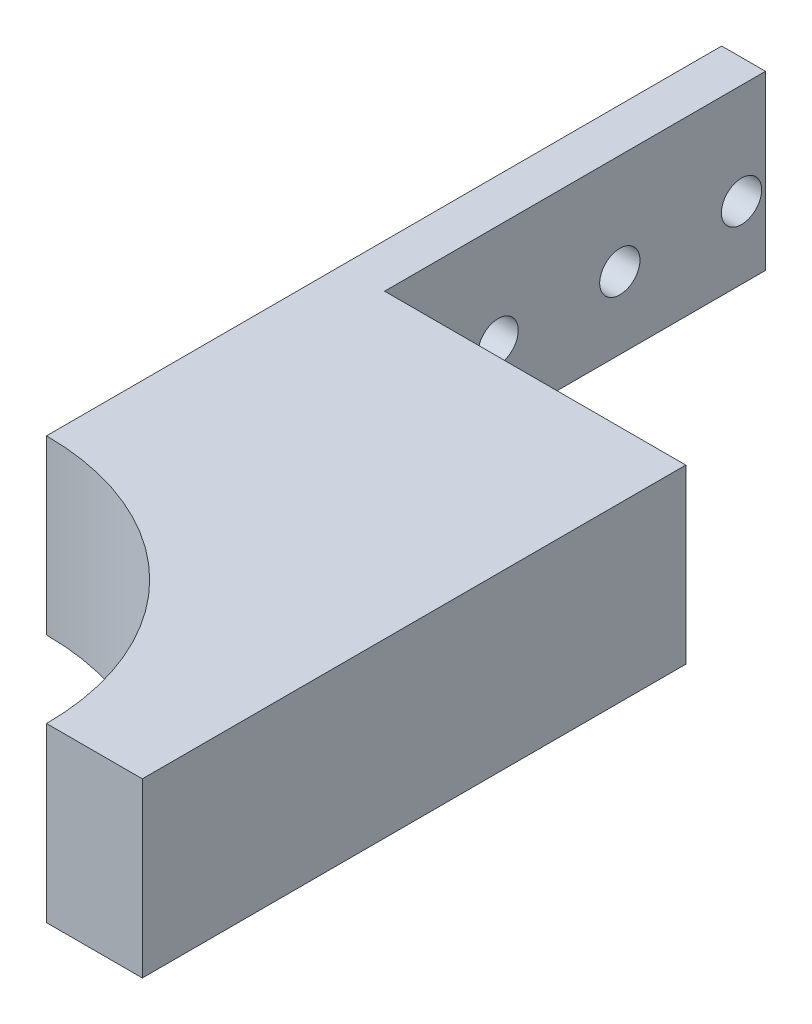
ISO-10303-21;
HEADER;
FILE_DESCRIPTION(('STEP AP214'),'2;1');
FILE_NAME('part.step','',(''),(''),'','','');
FILE_SCHEMA(('AUTOMOTIVE_DESIGN { 1 0 10303 214 1 1 1 1 }'));
ENDSEC;
DATA;
#1=APPLICATION_CONTEXT('core data for automotive mechanical design processes');
#2=APPLICATION_PROTOCOL_DEFINITION('international standard','automotive_design',2000,#1);
#3=PRODUCT_CONTEXT('',#1,'mechanical');
#4=PRODUCT('Part','Part','',(#3));
#5=PRODUCT_RELATED_PRODUCT_CATEGORY('part','',(#4));
#6=PRODUCT_DEFINITION_FORMATION('','',#4);
#7=PRODUCT_DEFINITION_CONTEXT('part definition',#1,'design');
#8=PRODUCT_DEFINITION('design','',#6,#7);
#9=PRODUCT_DEFINITION_SHAPE('','',#8);
#10=(LENGTH_UNIT() NAMED_UNIT(*) SI_UNIT(.MILLI.,.METRE.));
#11=(NAMED_UNIT(*) PLANE_ANGLE_UNIT() SI_UNIT($,.RADIAN.));
#12=(NAMED_UNIT(*) SI_UNIT($,.STERADIAN.) SOLID_ANGLE_UNIT());
#13=UNCERTAINTY_MEASURE_WITH_UNIT(LENGTH_MEASURE(1.E-05),#10,'distance_accuracy_value','');
#14=(GEOMETRIC_REPRESENTATION_CONTEXT(3) GLOBAL_UNCERTAINTY_ASSIGNED_CONTEXT((#13)) GLOBAL_UNIT_ASSIGNED_CONTEXT((#10,
#11,#12)) REPRESENTATION_CONTEXT('',''));
#15=CARTESIAN_POINT('',(0.,0.,0.));
#16=DIRECTION('',(0.,0.,1.));
#17=DIRECTION('',(1.,0.,0.));
#18=AXIS2_PLACEMENT_3D('',#15,#16,#17);
#19=CARTESIAN_POINT('',(-36.0000000000037,18.,0.));
#20=DIRECTION('',(0.,-1.,0.));
#21=DIRECTION('',(0.,0.,-1.));
#22=AXIS2_PLACEMENT_3D('',#19,#20,#21);
#23=CYLINDRICAL_SURFACE('',#22,26.);
#24=CARTESIAN_POINT('',(-36.0000000000037,0.,0.));
#25=DIRECTION('',(0.,-1.,0.));
#26=DIRECTION('',(0.,0.,-1.));
#27=AXIS2_PLACEMENT_3D('',#24,#25,#26);
#28=CIRCLE('',#27,26.);
#29=CARTESIAN_POINT('',(-36.0000000000037,0.,-26.));
#30=VERTEX_POINT('',#29);
#31=CARTESIAN_POINT('',(-10.0000000000037,0.,0.));
#32=VERTEX_POINT('',#31);
#33=EDGE_CURVE('E131',#30,#32,#28,.T.);
#34=ORIENTED_EDGE('',*,*,#33,.T.);
#35=DIRECTION('',(0.,-1.,0.));
#36=VECTOR('',#35,1.);
#37=CARTESIAN_POINT('',(-10.0000000000037,18.,0.));
#38=LINE('',#37,#36);
#39=CARTESIAN_POINT('',(-10.0000000000037,18.,0.));
#40=VERTEX_POINT('',#39);
#41=EDGE_CURVE('E11',#40,#32,#38,.T.);
#42=ORIENTED_EDGE('',*,*,#41,.F.);
#43=CARTESIAN_POINT('',(-36.0000000000037,18.,0.));
#44=DIRECTION('',(0.,-1.,0.));
#45=DIRECTION('',(0.,0.,-1.));
#46=AXIS2_PLACEMENT_3D('',#43,#44,#45);
#47=CIRCLE('',#46,26.);
#48=CARTESIAN_POINT('',(-36.0000000000037,18.,-26.));
#49=VERTEX_POINT('',#48);
#50=EDGE_CURVE('E143',#49,#40,#47,.T.);
#51=ORIENTED_EDGE('',*,*,#50,.F.);
#52=DIRECTION('',(0.,-1.,0.));
#53=VECTOR('',#52,1.);
#54=CARTESIAN_POINT('',(-36.0000000000037,18.,-26.));
#55=LINE('',#54,#53);
#56=EDGE_CURVE('E127',#49,#30,#55,.T.);
#57=ORIENTED_EDGE('',*,*,#56,.T.);
#58=EDGE_LOOP('',(#34,#42,#51,#57));
#59=FACE_BOUND('',#58,.T.);
#60=ADVANCED_FACE('F39',(#59),#23,.F.);
#61=CARTESIAN_POINT('',(-10.0000000000037,18.,0.));
#62=DIRECTION('',(0.,0.,-1.));
#63=DIRECTION('',(-1.,0.,0.));
#64=AXIS2_PLACEMENT_3D('',#61,#62,#63);
#65=PLANE('',#64);
#66=DIRECTION('',(1.,0.,0.));
#67=VECTOR('',#66,1.);
#68=CARTESIAN_POINT('',(-10.0000000000037,0.,0.));
#69=LINE('',#68,#67);
#70=CARTESIAN_POINT('',(0.,0.,0.));
#71=VERTEX_POINT('',#70);
#72=EDGE_CURVE('E134',#32,#71,#69,.T.);
#73=ORIENTED_EDGE('',*,*,#72,.T.);
#74=DIRECTION('',(0.,-1.,0.));
#75=VECTOR('',#74,1.);
#76=CARTESIAN_POINT('',(0.,18.,0.));
#77=LINE('',#76,#75);
#78=CARTESIAN_POINT('',(0.,18.,0.));
#79=VERTEX_POINT('',#78);
#80=EDGE_CURVE('E48',#79,#71,#77,.T.);
#81=ORIENTED_EDGE('',*,*,#80,.F.);
#82=DIRECTION('',(1.,0.,0.));
#83=VECTOR('',#82,1.);
#84=CARTESIAN_POINT('',(-10.0000000000037,18.,0.));
#85=LINE('',#84,#83);
#86=EDGE_CURVE('E97',#40,#79,#85,.T.);
#87=ORIENTED_EDGE('',*,*,#86,.F.);
#88=ORIENTED_EDGE('',*,*,#41,.T.);
#89=EDGE_LOOP('',(#73,#81,#87,#88));
#90=FACE_BOUND('',#89,.T.);
#91=ADVANCED_FACE('F178',(#90),#65,.F.);
#92=CARTESIAN_POINT('',(0.,18.,-56.7121010313984));
#93=DIRECTION('',(-1.,0.,0.));
#94=DIRECTION('',(0.,0.,1.));
#95=AXIS2_PLACEMENT_3D('',#92,#93,#94);
#96=PLANE('',#95);
#97=DIRECTION('',(0.,0.,-1.));
#98=VECTOR('',#97,1.);
#99=CARTESIAN_POINT('',(0.,0.,-56.7121010313984));
#100=LINE('',#99,#98);
#101=CARTESIAN_POINT('',(0.,0.,-56.7121010313984));
#102=VERTEX_POINT('',#101);
#103=EDGE_CURVE('E136',#71,#102,#100,.T.);
#104=ORIENTED_EDGE('',*,*,#103,.T.);
#105=DIRECTION('',(0.,-1.,0.));
#106=VECTOR('',#105,1.);
#107=CARTESIAN_POINT('',(0.,18.,-56.7121010313984));
#108=LINE('',#107,#106);
#109=CARTESIAN_POINT('',(0.,18.,-56.7121010313984));
#110=VERTEX_POINT('',#109);
#111=EDGE_CURVE('E147',#110,#102,#108,.T.);
#112=ORIENTED_EDGE('',*,*,#111,.F.);
#113=DIRECTION('',(0.,0.,-1.));
#114=VECTOR('',#113,1.);
#115=CARTESIAN_POINT('',(0.,18.,-56.7121010313984));
#116=LINE('',#115,#114);
#117=EDGE_CURVE('E194',#79,#110,#116,.T.);
#118=ORIENTED_EDGE('',*,*,#117,.F.);
#119=ORIENTED_EDGE('',*,*,#80,.T.);
#120=EDGE_LOOP('',(#104,#112,#118,#119));
#121=FACE_BOUND('',#120,.T.);
#122=ADVANCED_FACE('F183',(#121),#96,.F.);
#123=CARTESIAN_POINT('',(-31.43,18.,-56.7121010313984));
#124=DIRECTION('',(0.,0.,1.));
#125=DIRECTION('',(1.,0.,0.));
#126=AXIS2_PLACEMENT_3D('',#123,#124,#125);
#127=PLANE('',#126);
#128=DIRECTION('',(-1.,0.,0.));
#129=VECTOR('',#128,1.);
#130=CARTESIAN_POINT('',(-31.43,0.,-56.7121010313984));
#131=LINE('',#130,#129);
#132=CARTESIAN_POINT('',(-31.43,0.,-56.7121010313984));
#133=VERTEX_POINT('',#132);
#134=EDGE_CURVE('E138',#102,#133,#131,.T.);
#135=ORIENTED_EDGE('',*,*,#134,.T.);
#136=DIRECTION('',(0.,-1.,0.));
#137=VECTOR('',#136,1.);
#138=CARTESIAN_POINT('',(-31.43,18.,-56.7121010313984));
#139=LINE('',#138,#137);
#140=CARTESIAN_POINT('',(-31.43,18.,-56.7121010313984));
#141=VERTEX_POINT('',#140);
#142=EDGE_CURVE('E122',#141,#133,#139,.T.);
#143=ORIENTED_EDGE('',*,*,#142,.F.);
#144=DIRECTION('',(-1.,0.,0.));
#145=VECTOR('',#144,1.);
#146=CARTESIAN_POINT('',(-31.43,18.,-56.7121010313984));
#147=LINE('',#146,#145);
#148=EDGE_CURVE('E113',#110,#141,#147,.T.);
#149=ORIENTED_EDGE('',*,*,#148,.F.);
#150=ORIENTED_EDGE('',*,*,#111,.T.);
#151=EDGE_LOOP('',(#135,#143,#149,#150));
#152=FACE_BOUND('',#151,.T.);
#153=ADVANCED_FACE('F210',(#152),#127,.F.);
#154=CARTESIAN_POINT('',(-31.43,18.,-96.46));
#155=DIRECTION('',(-1.,0.,0.));
#156=DIRECTION('',(0.,0.,1.));
#157=AXIS2_PLACEMENT_3D('',#154,#155,#156);
#158=PLANE('',#157);
#159=CARTESIAN_POINT('',(-31.43,7.5,-68.56));
#160=DIRECTION('',(1.,0.,0.));
#161=DIRECTION('',(0.,0.,-1.));
#162=AXIS2_PLACEMENT_3D('',#159,#160,#161);
#163=CIRCLE('',#162,2.1);
#164=CARTESIAN_POINT('',(-31.43,7.5,-70.66));
#165=VERTEX_POINT('',#164);
#166=EDGE_CURVE('E202',#165,#165,#163,.T.);
#167=ORIENTED_EDGE('',*,*,#166,.F.);
#168=EDGE_LOOP('',(#167));
#169=FACE_BOUND('',#168,.T.);
#170=CARTESIAN_POINT('',(-31.43,7.5,-93.96));
#171=DIRECTION('',(1.,0.,0.));
#172=DIRECTION('',(0.,0.,-1.));
#173=AXIS2_PLACEMENT_3D('',#170,#171,#172);
#174=CIRCLE('',#173,2.09999999999999);
#175=CARTESIAN_POINT('',(-31.43,7.5,-96.06));
#176=VERTEX_POINT('',#175);
#177=EDGE_CURVE('E201',#176,#176,#174,.T.);
#178=ORIENTED_EDGE('',*,*,#177,.F.);
#179=EDGE_LOOP('',(#178));
#180=FACE_BOUND('',#179,.T.);
#181=CARTESIAN_POINT('',(-31.43,7.5,-81.26));
#182=DIRECTION('',(1.,0.,0.));
#183=DIRECTION('',(0.,0.,-1.));
#184=AXIS2_PLACEMENT_3D('',#181,#182,#183);
#185=CIRCLE('',#184,2.1);
#186=CARTESIAN_POINT('',(-31.43,7.5,-83.36));
#187=VERTEX_POINT('',#186);
#188=EDGE_CURVE('E155',#187,#187,#185,.T.);
#189=ORIENTED_EDGE('',*,*,#188,.F.);
#190=EDGE_LOOP('',(#189));
#191=FACE_BOUND('',#190,.T.);
#192=DIRECTION('',(0.,0.,-1.));
#193=VECTOR('',#192,1.);
#194=CARTESIAN_POINT('',(-31.43,0.,-96.46));
#195=LINE('',#194,#193);
#196=CARTESIAN_POINT('',(-31.43,0.,-96.46));
#197=VERTEX_POINT('',#196);
#198=EDGE_CURVE('E121',#133,#197,#195,.T.);
#199=ORIENTED_EDGE('',*,*,#198,.T.);
#200=DIRECTION('',(0.,-1.,0.));
#201=VECTOR('',#200,1.);
#202=CARTESIAN_POINT('',(-31.43,18.,-96.46));
#203=LINE('',#202,#201);
#204=CARTESIAN_POINT('',(-31.43,18.,-96.46));
#205=VERTEX_POINT('',#204);
#206=EDGE_CURVE('E118',#205,#197,#203,.T.);
#207=ORIENTED_EDGE('',*,*,#206,.F.);
#208=DIRECTION('',(0.,0.,-1.));
#209=VECTOR('',#208,1.);
#210=CARTESIAN_POINT('',(-31.43,18.,-96.46));
#211=LINE('',#210,#209);
#212=EDGE_CURVE('E107',#141,#205,#211,.T.);
#213=ORIENTED_EDGE('',*,*,#212,.F.);
#214=ORIENTED_EDGE('',*,*,#142,.T.);
#215=EDGE_LOOP('',(#199,#207,#213,#214));
#216=FACE_BOUND('',#215,.T.);
#217=ADVANCED_FACE('F119',(#169,#180,#191,#216),#158,.F.);
#218=CARTESIAN_POINT('',(-36.0000000000037,18.,-96.46));
#219=DIRECTION('',(0.,0.,1.));
#220=DIRECTION('',(1.,0.,0.));
#221=AXIS2_PLACEMENT_3D('',#218,#219,#220);
#222=PLANE('',#221);
#223=DIRECTION('',(-1.,0.,0.));
#224=VECTOR('',#223,1.);
#225=CARTESIAN_POINT('',(-36.0000000000037,0.,-96.46));
#226=LINE('',#225,#224);
#227=CARTESIAN_POINT('',(-36.0000000000037,0.,-96.46));
#228=VERTEX_POINT('',#227);
#229=EDGE_CURVE('E83',#197,#228,#226,.T.);
#230=ORIENTED_EDGE('',*,*,#229,.T.);
#231=DIRECTION('',(0.,-1.,0.));
#232=VECTOR('',#231,1.);
#233=CARTESIAN_POINT('',(-36.0000000000037,18.,-96.46));
#234=LINE('',#233,#232);
#235=CARTESIAN_POINT('',(-36.0000000000037,18.,-96.46));
#236=VERTEX_POINT('',#235);
#237=EDGE_CURVE('E123',#236,#228,#234,.T.);
#238=ORIENTED_EDGE('',*,*,#237,.F.);
#239=DIRECTION('',(-1.,0.,0.));
#240=VECTOR('',#239,1.);
#241=CARTESIAN_POINT('',(-36.0000000000037,18.,-96.46));
#242=LINE('',#241,#240);
#243=EDGE_CURVE('E111',#205,#236,#242,.T.);
#244=ORIENTED_EDGE('',*,*,#243,.F.);
#245=ORIENTED_EDGE('',*,*,#206,.T.);
#246=EDGE_LOOP('',(#230,#238,#244,#245));
#247=FACE_BOUND('',#246,.T.);
#248=ADVANCED_FACE('F125',(#247),#222,.F.);
#249=CARTESIAN_POINT('',(-36.0000000000037,18.,-96.46));
#250=DIRECTION('',(1.,0.,0.));
#251=DIRECTION('',(0.,0.,-1.));
#252=AXIS2_PLACEMENT_3D('',#249,#250,#251);
#253=PLANE('',#252);
#254=CARTESIAN_POINT('',(-36.0000000000037,7.5,-68.56));
#255=DIRECTION('',(1.,0.,0.));
#256=DIRECTION('',(0.,0.,-1.));
#257=AXIS2_PLACEMENT_3D('',#254,#255,#256);
#258=CIRCLE('',#257,2.1);
#259=CARTESIAN_POINT('',(-36.0000000000037,7.5,-70.66));
#260=VERTEX_POINT('',#259);
#261=EDGE_CURVE('E42',#260,#260,#258,.T.);
#262=ORIENTED_EDGE('',*,*,#261,.T.);
#263=EDGE_LOOP('',(#262));
#264=FACE_BOUND('',#263,.T.);
#265=CARTESIAN_POINT('',(-36.0000000000037,7.5,-93.96));
#266=DIRECTION('',(1.,0.,0.));
#267=DIRECTION('',(0.,0.,-1.));
#268=AXIS2_PLACEMENT_3D('',#265,#266,#267);
#269=CIRCLE('',#268,2.09999999999999);
#270=CARTESIAN_POINT('',(-36.0000000000037,7.5,-96.06));
#271=VERTEX_POINT('',#270);
#272=EDGE_CURVE('E154',#271,#271,#269,.T.);
#273=ORIENTED_EDGE('',*,*,#272,.T.);
#274=EDGE_LOOP('',(#273));
#275=FACE_BOUND('',#274,.T.);
#276=CARTESIAN_POINT('',(-36.0000000000037,7.5,-81.26));
#277=DIRECTION('',(1.,0.,0.));
#278=DIRECTION('',(0.,0.,-1.));
#279=AXIS2_PLACEMENT_3D('',#276,#277,#278);
#280=CIRCLE('',#279,2.1);
#281=CARTESIAN_POINT('',(-36.0000000000037,7.5,-83.36));
#282=VERTEX_POINT('',#281);
#283=EDGE_CURVE('E152',#282,#282,#280,.T.);
#284=ORIENTED_EDGE('',*,*,#283,.T.);
#285=EDGE_LOOP('',(#284));
#286=FACE_BOUND('',#285,.T.);
#287=DIRECTION('',(0.,0.,1.));
#288=VECTOR('',#287,1.);
#289=CARTESIAN_POINT('',(-36.0000000000037,0.,-96.46));
#290=LINE('',#289,#288);
#291=EDGE_CURVE('E89',#228,#30,#290,.T.);
#292=ORIENTED_EDGE('',*,*,#291,.T.);
#293=ORIENTED_EDGE('',*,*,#56,.F.);
#294=DIRECTION('',(0.,0.,1.));
#295=VECTOR('',#294,1.);
#296=CARTESIAN_POINT('',(-36.0000000000037,18.,-96.46));
#297=LINE('',#296,#295);
#298=EDGE_CURVE('E57',#236,#49,#297,.T.);
#299=ORIENTED_EDGE('',*,*,#298,.F.);
#300=ORIENTED_EDGE('',*,*,#237,.T.);
#301=EDGE_LOOP('',(#292,#293,#299,#300));
#302=FACE_BOUND('',#301,.T.);
#303=ADVANCED_FACE('F162',(#264,#275,#286,#302),#253,.F.);
#304=CARTESIAN_POINT('',(-36.0000000000037,18.,0.));
#305=DIRECTION('',(0.,-1.,0.));
#306=DIRECTION('',(0.,0.,-1.));
#307=AXIS2_PLACEMENT_3D('',#304,#305,#306);
#308=PLANE('',#307);
#309=ORIENTED_EDGE('',*,*,#50,.T.);
#310=ORIENTED_EDGE('',*,*,#86,.T.);
#311=ORIENTED_EDGE('',*,*,#117,.T.);
#312=ORIENTED_EDGE('',*,*,#148,.T.);
#313=ORIENTED_EDGE('',*,*,#212,.T.);
#314=ORIENTED_EDGE('',*,*,#243,.T.);
#315=ORIENTED_EDGE('',*,*,#298,.T.);
#316=EDGE_LOOP('',(#309,#310,#311,#312,#313,#314,#315));
#317=FACE_BOUND('',#316,.T.);
#318=ADVANCED_FACE('F109',(#317),#308,.F.);
#319=CARTESIAN_POINT('',(-36.0000000000037,0.,0.));
#320=DIRECTION('',(0.,-1.,0.));
#321=DIRECTION('',(0.,0.,-1.));
#322=AXIS2_PLACEMENT_3D('',#319,#320,#321);
#323=PLANE('',#322);
#324=ORIENTED_EDGE('',*,*,#33,.F.);
#325=ORIENTED_EDGE('',*,*,#291,.F.);
#326=ORIENTED_EDGE('',*,*,#229,.F.);
#327=ORIENTED_EDGE('',*,*,#198,.F.);
#328=ORIENTED_EDGE('',*,*,#134,.F.);
#329=ORIENTED_EDGE('',*,*,#103,.F.);
#330=ORIENTED_EDGE('',*,*,#72,.F.);
#331=EDGE_LOOP('',(#324,#325,#326,#327,#328,#329,#330));
#332=FACE_BOUND('',#331,.T.);
#333=ADVANCED_FACE('F188',(#332),#323,.T.);
#334=CARTESIAN_POINT('',(-41.43,7.5,-81.26));
#335=DIRECTION('',(1.,0.,0.));
#336=DIRECTION('',(0.,0.,-1.));
#337=AXIS2_PLACEMENT_3D('',#334,#335,#336);
#338=CYLINDRICAL_SURFACE('',#337,2.1);
#339=ORIENTED_EDGE('',*,*,#188,.T.);
#340=EDGE_LOOP('',(#339));
#341=FACE_BOUND('',#340,.T.);
#342=ORIENTED_EDGE('',*,*,#283,.F.);
#343=EDGE_LOOP('',(#342));
#344=FACE_BOUND('',#343,.T.);
#345=ADVANCED_FACE('F172',(#341,#344),#338,.F.);
#346=CARTESIAN_POINT('',(-41.43,7.5,-93.96));
#347=DIRECTION('',(1.,0.,0.));
#348=DIRECTION('',(0.,0.,-1.));
#349=AXIS2_PLACEMENT_3D('',#346,#347,#348);
#350=CYLINDRICAL_SURFACE('',#349,2.09999999999999);
#351=ORIENTED_EDGE('',*,*,#177,.T.);
#352=EDGE_LOOP('',(#351));
#353=FACE_BOUND('',#352,.T.);
#354=ORIENTED_EDGE('',*,*,#272,.F.);
#355=EDGE_LOOP('',(#354));
#356=FACE_BOUND('',#355,.T.);
#357=ADVANCED_FACE('F166',(#353,#356),#350,.F.);
#358=CARTESIAN_POINT('',(-41.43,7.5,-68.56));
#359=DIRECTION('',(1.,0.,0.));
#360=DIRECTION('',(0.,0.,-1.));
#361=AXIS2_PLACEMENT_3D('',#358,#359,#360);
#362=CYLINDRICAL_SURFACE('',#361,2.1);
#363=ORIENTED_EDGE('',*,*,#166,.T.);
#364=EDGE_LOOP('',(#363));
#365=FACE_BOUND('',#364,.T.);
#366=ORIENTED_EDGE('',*,*,#261,.F.);
#367=EDGE_LOOP('',(#366));
#368=FACE_BOUND('',#367,.T.);
#369=ADVANCED_FACE('F164',(#365,#368),#362,.F.);
#370=CLOSED_SHELL('',(#60,#91,#122,#153,#217,#248,#303,#318,#333,#345,#357,#369));
#371=MANIFOLD_SOLID_BREP('B2',#370);
#372=ADVANCED_BREP_SHAPE_REPRESENTATION('',(#18,#371),#14);
#373=SHAPE_DEFINITION_REPRESENTATION(#9,#372);
ENDSEC;
END-ISO-10303-21;
